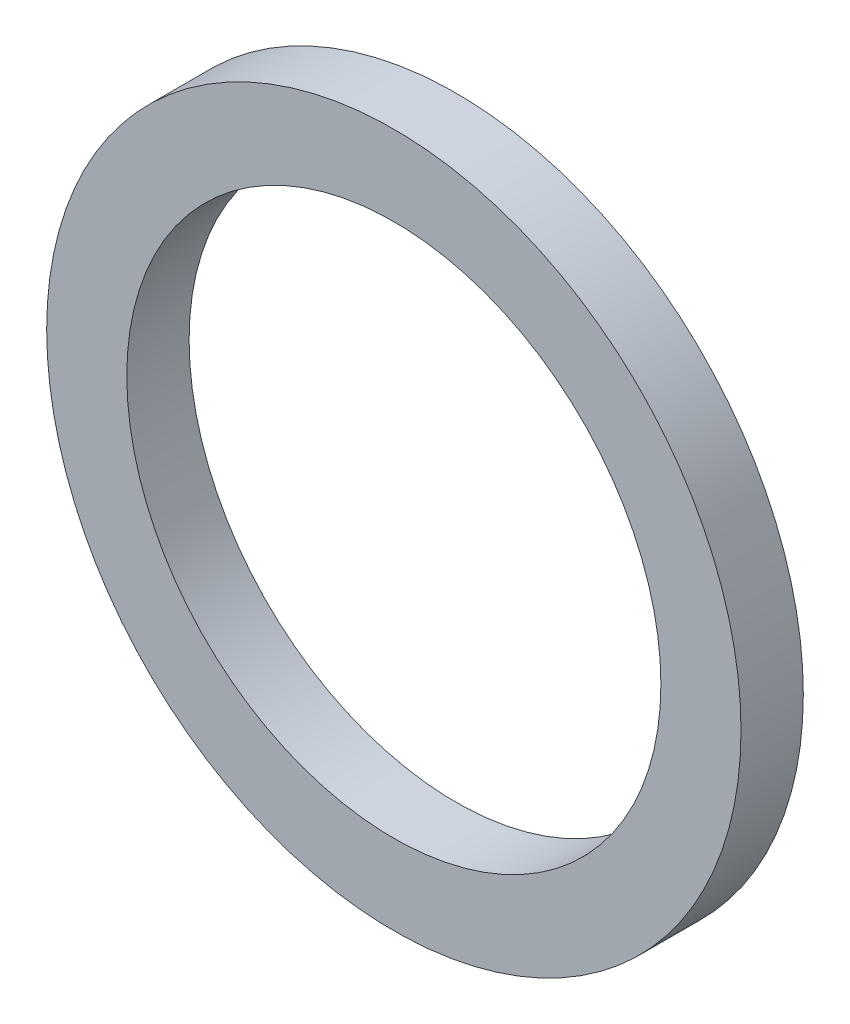
ISO-10303-21;
HEADER;
FILE_DESCRIPTION(('STEP AP214'),'2;1');
FILE_NAME('part.step','',(''),(''),'','','');
FILE_SCHEMA(('AUTOMOTIVE_DESIGN { 1 0 10303 214 1 1 1 1 }'));
ENDSEC;
DATA;
#1=APPLICATION_CONTEXT('core data for automotive mechanical design processes');
#2=APPLICATION_PROTOCOL_DEFINITION('international standard','automotive_design',2000,#1);
#3=PRODUCT_CONTEXT('',#1,'mechanical');
#4=PRODUCT('Part','Part','',(#3));
#5=PRODUCT_RELATED_PRODUCT_CATEGORY('part','',(#4));
#6=PRODUCT_DEFINITION_FORMATION('','',#4);
#7=PRODUCT_DEFINITION_CONTEXT('part definition',#1,'design');
#8=PRODUCT_DEFINITION('design','',#6,#7);
#9=PRODUCT_DEFINITION_SHAPE('','',#8);
#10=(LENGTH_UNIT() NAMED_UNIT(*) SI_UNIT(.MILLI.,.METRE.));
#11=(NAMED_UNIT(*) PLANE_ANGLE_UNIT() SI_UNIT($,.RADIAN.));
#12=(NAMED_UNIT(*) SI_UNIT($,.STERADIAN.) SOLID_ANGLE_UNIT());
#13=UNCERTAINTY_MEASURE_WITH_UNIT(LENGTH_MEASURE(1.E-05),#10,'distance_accuracy_value','');
#14=(GEOMETRIC_REPRESENTATION_CONTEXT(3) GLOBAL_UNCERTAINTY_ASSIGNED_CONTEXT((#13)) GLOBAL_UNIT_ASSIGNED_CONTEXT((#10,
#11,#12)) REPRESENTATION_CONTEXT('',''));
#15=CARTESIAN_POINT('',(0.,0.,0.));
#16=DIRECTION('',(0.,0.,1.));
#17=DIRECTION('',(1.,0.,0.));
#18=AXIS2_PLACEMENT_3D('',#15,#16,#17);
#19=CARTESIAN_POINT('',(0.,0.,0.));
#20=DIRECTION('',(0.,0.,1.));
#21=DIRECTION('',(1.,0.,0.));
#22=AXIS2_PLACEMENT_3D('',#19,#20,#21);
#23=PLANE('',#22);
#24=CARTESIAN_POINT('',(0.,0.,0.));
#25=DIRECTION('',(0.,0.,-1.));
#26=DIRECTION('',(-1.,0.,0.));
#27=AXIS2_PLACEMENT_3D('',#24,#25,#26);
#28=CIRCLE('',#27,15.);
#29=CARTESIAN_POINT('',(-15.,0.,0.));
#30=VERTEX_POINT('',#29);
#31=EDGE_CURVE('E26',#30,#30,#28,.F.);
#32=ORIENTED_EDGE('',*,*,#31,.T.);
#33=EDGE_LOOP('',(#32));
#34=FACE_BOUND('',#33,.T.);
#35=CARTESIAN_POINT('',(0.,0.,0.));
#36=DIRECTION('',(0.,0.,-1.));
#37=DIRECTION('',(-1.,0.,0.));
#38=AXIS2_PLACEMENT_3D('',#35,#36,#37);
#39=CIRCLE('',#38,19.5);
#40=CARTESIAN_POINT('',(-19.5,0.,0.));
#41=VERTEX_POINT('',#40);
#42=EDGE_CURVE('E17',#41,#41,#39,.F.);
#43=ORIENTED_EDGE('',*,*,#42,.F.);
#44=EDGE_LOOP('',(#43));
#45=FACE_BOUND('',#44,.T.);
#46=ADVANCED_FACE('F14',(#34,#45),#23,.F.);
#47=CARTESIAN_POINT('',(0.,0.,3.5));
#48=DIRECTION('',(0.,0.,-1.));
#49=DIRECTION('',(-1.,0.,0.));
#50=AXIS2_PLACEMENT_3D('',#47,#48,#49);
#51=CYLINDRICAL_SURFACE('',#50,19.5);
#52=ORIENTED_EDGE('',*,*,#42,.T.);
#53=EDGE_LOOP('',(#52));
#54=FACE_BOUND('',#53,.T.);
#55=CARTESIAN_POINT('',(0.,0.,3.5));
#56=DIRECTION('',(0.,0.,-1.));
#57=DIRECTION('',(-1.,0.,0.));
#58=AXIS2_PLACEMENT_3D('',#55,#56,#57);
#59=CIRCLE('',#58,19.5);
#60=CARTESIAN_POINT('',(-19.5,0.,3.5));
#61=VERTEX_POINT('',#60);
#62=EDGE_CURVE('E21',#61,#61,#59,.F.);
#63=ORIENTED_EDGE('',*,*,#62,.F.);
#64=EDGE_LOOP('',(#63));
#65=FACE_BOUND('',#64,.T.);
#66=ADVANCED_FACE('F34',(#54,#65),#51,.T.);
#67=CARTESIAN_POINT('',(0.,0.,3.5));
#68=DIRECTION('',(0.,0.,-1.));
#69=DIRECTION('',(-1.,0.,0.));
#70=AXIS2_PLACEMENT_3D('',#67,#68,#69);
#71=CYLINDRICAL_SURFACE('',#70,15.);
#72=ORIENTED_EDGE('',*,*,#31,.F.);
#73=EDGE_LOOP('',(#72));
#74=FACE_BOUND('',#73,.T.);
#75=CARTESIAN_POINT('',(0.,0.,3.5));
#76=DIRECTION('',(0.,0.,-1.));
#77=DIRECTION('',(-1.,0.,0.));
#78=AXIS2_PLACEMENT_3D('',#75,#76,#77);
#79=CIRCLE('',#78,15.);
#80=CARTESIAN_POINT('',(-15.,0.,3.5));
#81=VERTEX_POINT('',#80);
#82=EDGE_CURVE('E10',#81,#81,#79,.T.);
#83=ORIENTED_EDGE('',*,*,#82,.F.);
#84=EDGE_LOOP('',(#83));
#85=FACE_BOUND('',#84,.T.);
#86=ADVANCED_FACE('F42',(#74,#85),#71,.F.);
#87=CARTESIAN_POINT('',(0.,0.,3.5));
#88=DIRECTION('',(0.,0.,1.));
#89=DIRECTION('',(1.,0.,0.));
#90=AXIS2_PLACEMENT_3D('',#87,#88,#89);
#91=PLANE('',#90);
#92=ORIENTED_EDGE('',*,*,#82,.T.);
#93=EDGE_LOOP('',(#92));
#94=FACE_BOUND('',#93,.T.);
#95=ORIENTED_EDGE('',*,*,#62,.T.);
#96=EDGE_LOOP('',(#95));
#97=FACE_BOUND('',#96,.T.);
#98=ADVANCED_FACE('F43',(#94,#97),#91,.T.);
#99=CLOSED_SHELL('',(#46,#66,#86,#98));
#100=MANIFOLD_SOLID_BREP('B1',#99);
#101=ADVANCED_BREP_SHAPE_REPRESENTATION('',(#18,#100),#14);
#102=SHAPE_DEFINITION_REPRESENTATION(#9,#101);
ENDSEC;
END-ISO-10303-21;
